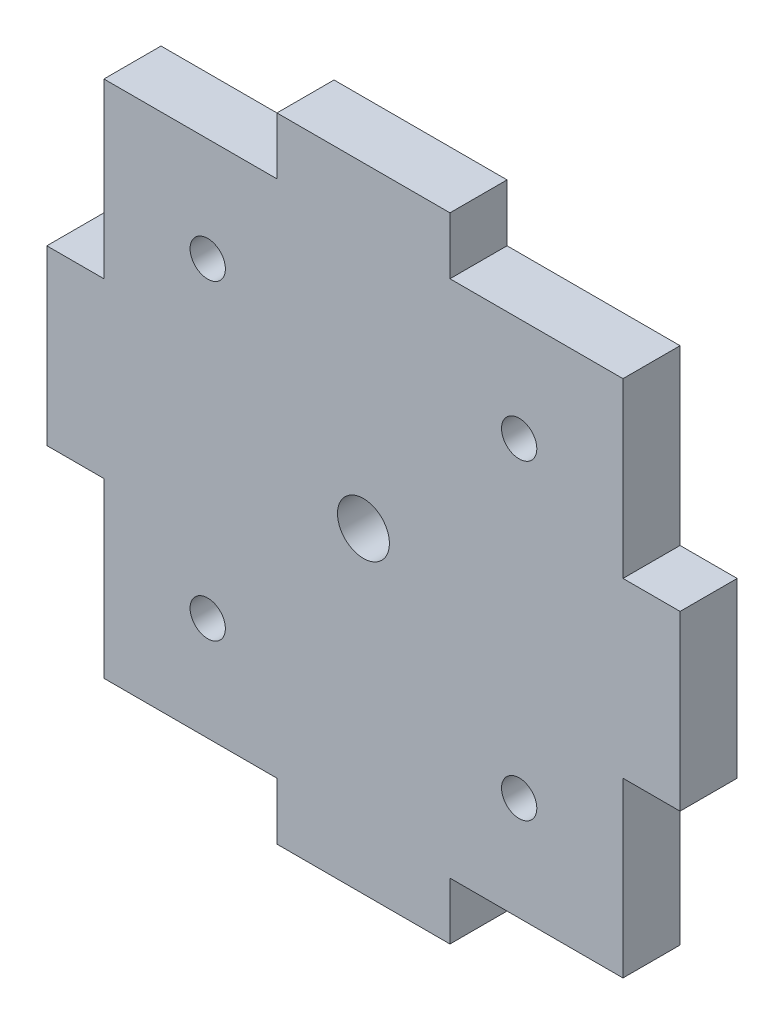
ISO-10303-21;
HEADER;
FILE_DESCRIPTION(('STEP AP214'),'2;1');
FILE_NAME('part.step','',(''),(''),'','','');
FILE_SCHEMA(('AUTOMOTIVE_DESIGN { 1 0 10303 214 1 1 1 1 }'));
ENDSEC;
DATA;
#1=APPLICATION_CONTEXT('core data for automotive mechanical design processes');
#2=APPLICATION_PROTOCOL_DEFINITION('international standard','automotive_design',2000,#1);
#3=PRODUCT_CONTEXT('',#1,'mechanical');
#4=PRODUCT('Part','Part','',(#3));
#5=PRODUCT_RELATED_PRODUCT_CATEGORY('part','',(#4));
#6=PRODUCT_DEFINITION_FORMATION('','',#4);
#7=PRODUCT_DEFINITION_CONTEXT('part definition',#1,'design');
#8=PRODUCT_DEFINITION('design','',#6,#7);
#9=PRODUCT_DEFINITION_SHAPE('','',#8);
#10=(LENGTH_UNIT() NAMED_UNIT(*) SI_UNIT(.MILLI.,.METRE.));
#11=(NAMED_UNIT(*) PLANE_ANGLE_UNIT() SI_UNIT($,.RADIAN.));
#12=(NAMED_UNIT(*) SI_UNIT($,.STERADIAN.) SOLID_ANGLE_UNIT());
#13=UNCERTAINTY_MEASURE_WITH_UNIT(LENGTH_MEASURE(1.E-05),#10,'distance_accuracy_value','');
#14=(GEOMETRIC_REPRESENTATION_CONTEXT(3) GLOBAL_UNCERTAINTY_ASSIGNED_CONTEXT((#13)) GLOBAL_UNIT_ASSIGNED_CONTEXT((#10,
#11,#12)) REPRESENTATION_CONTEXT('',''));
#15=CARTESIAN_POINT('',(0.,0.,0.));
#16=DIRECTION('',(0.,0.,1.));
#17=DIRECTION('',(1.,0.,0.));
#18=AXIS2_PLACEMENT_3D('',#15,#16,#17);
#19=CARTESIAN_POINT('',(0.,61.,5.5));
#20=DIRECTION('',(0.,0.,-1.));
#21=DIRECTION('',(-1.,0.,0.));
#22=AXIS2_PLACEMENT_3D('',#19,#20,#21);
#23=PLANE('',#22);
#24=CARTESIAN_POINT('',(45.5,45.5,5.49999999999999));
#25=DIRECTION('',(0.,0.,-1.));
#26=DIRECTION('',(1.,0.,0.));
#27=AXIS2_PLACEMENT_3D('',#24,#25,#26);
#28=CIRCLE('',#27,1.7);
#29=CARTESIAN_POINT('',(47.2,45.5,5.49999999999999));
#30=VERTEX_POINT('',#29);
#31=EDGE_CURVE('E610',#30,#30,#28,.T.);
#32=ORIENTED_EDGE('',*,*,#31,.T.);
#33=EDGE_LOOP('',(#32));
#34=FACE_BOUND('',#33,.T.);
#35=CARTESIAN_POINT('',(15.5,45.5,5.49999999999999));
#36=DIRECTION('',(0.,0.,-1.));
#37=DIRECTION('',(-1.,0.,0.));
#38=AXIS2_PLACEMENT_3D('',#35,#36,#37);
#39=CIRCLE('',#38,1.7);
#40=CARTESIAN_POINT('',(13.8,45.5,5.49999999999999));
#41=VERTEX_POINT('',#40);
#42=EDGE_CURVE('E202',#41,#41,#39,.T.);
#43=ORIENTED_EDGE('',*,*,#42,.T.);
#44=EDGE_LOOP('',(#43));
#45=FACE_BOUND('',#44,.T.);
#46=CARTESIAN_POINT('',(30.5,30.5,5.49999999999999));
#47=DIRECTION('',(0.,0.,-1.));
#48=DIRECTION('',(-1.,0.,0.));
#49=AXIS2_PLACEMENT_3D('',#46,#47,#48);
#50=CIRCLE('',#49,2.5);
#51=CARTESIAN_POINT('',(28.,30.5,5.49999999999999));
#52=VERTEX_POINT('',#51);
#53=EDGE_CURVE('E617',#52,#52,#50,.T.);
#54=ORIENTED_EDGE('',*,*,#53,.T.);
#55=EDGE_LOOP('',(#54));
#56=FACE_BOUND('',#55,.T.);
#57=CARTESIAN_POINT('',(45.5,15.5,5.49999999999999));
#58=DIRECTION('',(0.,0.,-1.));
#59=DIRECTION('',(-1.,0.,0.));
#60=AXIS2_PLACEMENT_3D('',#57,#58,#59);
#61=CIRCLE('',#60,1.7);
#62=CARTESIAN_POINT('',(43.8,15.5,5.49999999999999));
#63=VERTEX_POINT('',#62);
#64=EDGE_CURVE('E599',#63,#63,#61,.T.);
#65=ORIENTED_EDGE('',*,*,#64,.T.);
#66=EDGE_LOOP('',(#65));
#67=FACE_BOUND('',#66,.T.);
#68=CARTESIAN_POINT('',(15.5,15.5,5.49999999999999));
#69=DIRECTION('',(0.,0.,-1.));
#70=DIRECTION('',(-1.,0.,0.));
#71=AXIS2_PLACEMENT_3D('',#68,#69,#70);
#72=CIRCLE('',#71,1.7);
#73=CARTESIAN_POINT('',(13.8,15.5,5.49999999999999));
#74=VERTEX_POINT('',#73);
#75=EDGE_CURVE('E600',#74,#74,#72,.T.);
#76=ORIENTED_EDGE('',*,*,#75,.T.);
#77=EDGE_LOOP('',(#76));
#78=FACE_BOUND('',#77,.T.);
#79=DIRECTION('',(1.,0.,0.));
#80=VECTOR('',#79,1.);
#81=CARTESIAN_POINT('',(55.5,22.1666666666667,5.50000000000002));
#82=LINE('',#81,#80);
#83=CARTESIAN_POINT('',(55.5,22.1666666666667,5.50000000000002));
#84=VERTEX_POINT('',#83);
#85=CARTESIAN_POINT('',(61.,22.1666666666667,5.50000000000002));
#86=VERTEX_POINT('',#85);
#87=EDGE_CURVE('E297',#84,#86,#82,.T.);
#88=ORIENTED_EDGE('',*,*,#87,.T.);
#89=DIRECTION('',(0.,1.,0.));
#90=VECTOR('',#89,1.);
#91=CARTESIAN_POINT('',(61.,0.,5.5));
#92=LINE('',#91,#90);
#93=CARTESIAN_POINT('',(61.,38.8333333333333,5.50000000000002));
#94=VERTEX_POINT('',#93);
#95=EDGE_CURVE('E307',#86,#94,#92,.T.);
#96=ORIENTED_EDGE('',*,*,#95,.T.);
#97=DIRECTION('',(1.,0.,0.));
#98=VECTOR('',#97,1.);
#99=CARTESIAN_POINT('',(55.5,38.8333333333333,5.50000000000002));
#100=LINE('',#99,#98);
#101=CARTESIAN_POINT('',(55.5,38.8333333333333,5.50000000000002));
#102=VERTEX_POINT('',#101);
#103=EDGE_CURVE('E286',#102,#94,#100,.T.);
#104=ORIENTED_EDGE('',*,*,#103,.F.);
#105=DIRECTION('',(0.,1.,0.));
#106=VECTOR('',#105,1.);
#107=CARTESIAN_POINT('',(55.5,55.5,5.50000000000002));
#108=LINE('',#107,#106);
#109=CARTESIAN_POINT('',(55.5,55.5,5.50000000000002));
#110=VERTEX_POINT('',#109);
#111=EDGE_CURVE('E196',#102,#110,#108,.T.);
#112=ORIENTED_EDGE('',*,*,#111,.T.);
#113=DIRECTION('',(-1.,0.,0.));
#114=VECTOR('',#113,1.);
#115=CARTESIAN_POINT('',(55.5,55.5,5.50000000000001));
#116=LINE('',#115,#114);
#117=CARTESIAN_POINT('',(38.8333333333333,55.5,5.50000000000001));
#118=VERTEX_POINT('',#117);
#119=EDGE_CURVE('E187',#110,#118,#116,.T.);
#120=ORIENTED_EDGE('',*,*,#119,.T.);
#121=DIRECTION('',(0.,1.,0.));
#122=VECTOR('',#121,1.);
#123=CARTESIAN_POINT('',(38.8333333333333,55.5,5.50000000000001));
#124=LINE('',#123,#122);
#125=CARTESIAN_POINT('',(38.8333333333333,61.,5.50000000000001));
#126=VERTEX_POINT('',#125);
#127=EDGE_CURVE('E170',#118,#126,#124,.T.);
#128=ORIENTED_EDGE('',*,*,#127,.T.);
#129=DIRECTION('',(-1.,0.,0.));
#130=VECTOR('',#129,1.);
#131=CARTESIAN_POINT('',(0.,61.,5.5));
#132=LINE('',#131,#130);
#133=CARTESIAN_POINT('',(22.1666666666667,61.,5.50000000000001));
#134=VERTEX_POINT('',#133);
#135=EDGE_CURVE('E310',#126,#134,#132,.T.);
#136=ORIENTED_EDGE('',*,*,#135,.T.);
#137=DIRECTION('',(0.,1.,0.));
#138=VECTOR('',#137,1.);
#139=CARTESIAN_POINT('',(22.1666666666667,55.5,5.50000000000001));
#140=LINE('',#139,#138);
#141=CARTESIAN_POINT('',(22.1666666666667,55.5,5.50000000000001));
#142=VERTEX_POINT('',#141);
#143=EDGE_CURVE('E209',#142,#134,#140,.T.);
#144=ORIENTED_EDGE('',*,*,#143,.F.);
#145=DIRECTION('',(-1.,0.,0.));
#146=VECTOR('',#145,1.);
#147=CARTESIAN_POINT('',(5.5,55.5,5.50000000000001));
#148=LINE('',#147,#146);
#149=CARTESIAN_POINT('',(5.5,55.5,5.5));
#150=VERTEX_POINT('',#149);
#151=EDGE_CURVE('E206',#142,#150,#148,.T.);
#152=ORIENTED_EDGE('',*,*,#151,.T.);
#153=DIRECTION('',(0.,-1.,0.));
#154=VECTOR('',#153,1.);
#155=CARTESIAN_POINT('',(5.5,55.5,5.5));
#156=LINE('',#155,#154);
#157=CARTESIAN_POINT('',(5.5,38.8333333333334,5.5));
#158=VERTEX_POINT('',#157);
#159=EDGE_CURVE('E218',#150,#158,#156,.T.);
#160=ORIENTED_EDGE('',*,*,#159,.T.);
#161=DIRECTION('',(-1.,0.,0.));
#162=VECTOR('',#161,1.);
#163=CARTESIAN_POINT('',(5.5,38.8333333333334,5.5));
#164=LINE('',#163,#162);
#165=CARTESIAN_POINT('',(0.,38.8333333333334,5.5));
#166=VERTEX_POINT('',#165);
#167=EDGE_CURVE('E240',#158,#166,#164,.T.);
#168=ORIENTED_EDGE('',*,*,#167,.T.);
#169=DIRECTION('',(0.,-1.,0.));
#170=VECTOR('',#169,1.);
#171=CARTESIAN_POINT('',(0.,0.,5.5));
#172=LINE('',#171,#170);
#173=CARTESIAN_POINT('',(0.,22.1666666666667,5.49999999999999));
#174=VERTEX_POINT('',#173);
#175=EDGE_CURVE('E300',#166,#174,#172,.T.);
#176=ORIENTED_EDGE('',*,*,#175,.T.);
#177=DIRECTION('',(-1.,0.,0.));
#178=VECTOR('',#177,1.);
#179=CARTESIAN_POINT('',(5.5,22.1666666666667,5.49999999999999));
#180=LINE('',#179,#178);
#181=CARTESIAN_POINT('',(5.5,22.1666666666667,5.49999999999999));
#182=VERTEX_POINT('',#181);
#183=EDGE_CURVE('E229',#182,#174,#180,.T.);
#184=ORIENTED_EDGE('',*,*,#183,.F.);
#185=DIRECTION('',(0.,-1.,0.));
#186=VECTOR('',#185,1.);
#187=CARTESIAN_POINT('',(5.5,5.50000000000003,5.49999999999999));
#188=LINE('',#187,#186);
#189=CARTESIAN_POINT('',(5.5,5.5,5.5));
#190=VERTEX_POINT('',#189);
#191=EDGE_CURVE('E226',#182,#190,#188,.T.);
#192=ORIENTED_EDGE('',*,*,#191,.T.);
#193=DIRECTION('',(1.,0.,0.));
#194=VECTOR('',#193,1.);
#195=CARTESIAN_POINT('',(5.50000000000001,5.5,5.5));
#196=LINE('',#195,#194);
#197=CARTESIAN_POINT('',(22.1666666666667,5.5,5.50000000000001));
#198=VERTEX_POINT('',#197);
#199=EDGE_CURVE('E246',#190,#198,#196,.T.);
#200=ORIENTED_EDGE('',*,*,#199,.T.);
#201=DIRECTION('',(0.,-1.,0.));
#202=VECTOR('',#201,1.);
#203=CARTESIAN_POINT('',(22.1666666666667,5.5,5.50000000000001));
#204=LINE('',#203,#202);
#205=CARTESIAN_POINT('',(22.1666666666667,0.,5.50000000000001));
#206=VERTEX_POINT('',#205);
#207=EDGE_CURVE('E268',#198,#206,#204,.T.);
#208=ORIENTED_EDGE('',*,*,#207,.T.);
#209=DIRECTION('',(1.,0.,0.));
#210=VECTOR('',#209,1.);
#211=CARTESIAN_POINT('',(0.,0.,5.5));
#212=LINE('',#211,#210);
#213=CARTESIAN_POINT('',(38.8333333333333,0.,5.5));
#214=VERTEX_POINT('',#213);
#215=EDGE_CURVE('E303',#206,#214,#212,.T.);
#216=ORIENTED_EDGE('',*,*,#215,.T.);
#217=DIRECTION('',(0.,-1.,0.));
#218=VECTOR('',#217,1.);
#219=CARTESIAN_POINT('',(38.8333333333333,5.5,5.5));
#220=LINE('',#219,#218);
#221=CARTESIAN_POINT('',(38.8333333333333,5.5,5.5));
#222=VERTEX_POINT('',#221);
#223=EDGE_CURVE('E257',#222,#214,#220,.T.);
#224=ORIENTED_EDGE('',*,*,#223,.F.);
#225=DIRECTION('',(1.,0.,0.));
#226=VECTOR('',#225,1.);
#227=CARTESIAN_POINT('',(55.5,5.5,5.50000000000001));
#228=LINE('',#227,#226);
#229=CARTESIAN_POINT('',(55.5,5.5,5.50000000000002));
#230=VERTEX_POINT('',#229);
#231=EDGE_CURVE('E254',#222,#230,#228,.T.);
#232=ORIENTED_EDGE('',*,*,#231,.T.);
#233=DIRECTION('',(0.,1.,0.));
#234=VECTOR('',#233,1.);
#235=CARTESIAN_POINT('',(55.5,5.50000000000001,5.50000000000002));
#236=LINE('',#235,#234);
#237=EDGE_CURVE('E274',#230,#84,#236,.T.);
#238=ORIENTED_EDGE('',*,*,#237,.T.);
#239=EDGE_LOOP('',(#88,#96,#104,#112,#120,#128,#136,#144,#152,#160,#168,#176,#184,#192,#200,
#208,#216,#224,#232,#238));
#240=FACE_BOUND('',#239,.T.);
#241=ADVANCED_FACE('F31',(#34,#45,#56,#67,#78,#240),#23,.F.);
#242=CARTESIAN_POINT('',(0.,61.,0.));
#243=DIRECTION('',(0.,0.,-1.));
#244=DIRECTION('',(-1.,0.,0.));
#245=AXIS2_PLACEMENT_3D('',#242,#243,#244);
#246=PLANE('',#245);
#247=DIRECTION('',(0.,-1.,0.));
#248=VECTOR('',#247,1.);
#249=CARTESIAN_POINT('',(5.5,61.,0.));
#250=LINE('',#249,#248);
#251=CARTESIAN_POINT('',(5.5,22.1666666666667,0.));
#252=VERTEX_POINT('',#251);
#253=CARTESIAN_POINT('',(5.50000000000001,5.5,0.));
#254=VERTEX_POINT('',#253);
#255=EDGE_CURVE('E11',#252,#254,#250,.T.);
#256=ORIENTED_EDGE('',*,*,#255,.F.);
#257=DIRECTION('',(-1.,0.,0.));
#258=VECTOR('',#257,1.);
#259=CARTESIAN_POINT('',(5.5,22.1666666666667,0.));
#260=LINE('',#259,#258);
#261=CARTESIAN_POINT('',(0.,22.1666666666667,0.));
#262=VERTEX_POINT('',#261);
#263=EDGE_CURVE('E235',#252,#262,#260,.T.);
#264=ORIENTED_EDGE('',*,*,#263,.T.);
#265=DIRECTION('',(0.,-1.,0.));
#266=VECTOR('',#265,1.);
#267=CARTESIAN_POINT('',(0.,0.,0.));
#268=LINE('',#267,#266);
#269=CARTESIAN_POINT('',(0.,38.8333333333334,0.));
#270=VERTEX_POINT('',#269);
#271=EDGE_CURVE('E299',#270,#262,#268,.T.);
#272=ORIENTED_EDGE('',*,*,#271,.F.);
#273=DIRECTION('',(-1.,0.,0.));
#274=VECTOR('',#273,1.);
#275=CARTESIAN_POINT('',(5.5,38.8333333333334,0.));
#276=LINE('',#275,#274);
#277=CARTESIAN_POINT('',(5.5,38.8333333333334,0.));
#278=VERTEX_POINT('',#277);
#279=EDGE_CURVE('E238',#278,#270,#276,.T.);
#280=ORIENTED_EDGE('',*,*,#279,.F.);
#281=CARTESIAN_POINT('',(5.5,55.5,0.));
#282=VERTEX_POINT('',#281);
#283=EDGE_CURVE('E42',#282,#278,#250,.T.);
#284=ORIENTED_EDGE('',*,*,#283,.F.);
#285=DIRECTION('',(-1.,0.,0.));
#286=VECTOR('',#285,1.);
#287=CARTESIAN_POINT('',(0.,55.5,0.));
#288=LINE('',#287,#286);
#289=CARTESIAN_POINT('',(22.1666666666667,55.5,0.));
#290=VERTEX_POINT('',#289);
#291=EDGE_CURVE('E312',#290,#282,#288,.T.);
#292=ORIENTED_EDGE('',*,*,#291,.F.);
#293=DIRECTION('',(0.,1.,0.));
#294=VECTOR('',#293,1.);
#295=CARTESIAN_POINT('',(22.1666666666667,55.5,0.));
#296=LINE('',#295,#294);
#297=CARTESIAN_POINT('',(22.1666666666667,61.,0.));
#298=VERTEX_POINT('',#297);
#299=EDGE_CURVE('E212',#290,#298,#296,.T.);
#300=ORIENTED_EDGE('',*,*,#299,.T.);
#301=DIRECTION('',(-1.,0.,0.));
#302=VECTOR('',#301,1.);
#303=CARTESIAN_POINT('',(0.,61.,0.));
#304=LINE('',#303,#302);
#305=CARTESIAN_POINT('',(38.8333333333333,61.,0.));
#306=VERTEX_POINT('',#305);
#307=EDGE_CURVE('E304',#306,#298,#304,.T.);
#308=ORIENTED_EDGE('',*,*,#307,.F.);
#309=DIRECTION('',(0.,1.,0.));
#310=VECTOR('',#309,1.);
#311=CARTESIAN_POINT('',(38.8333333333333,55.5,0.));
#312=LINE('',#311,#310);
#313=CARTESIAN_POINT('',(38.8333333333333,55.5,0.));
#314=VERTEX_POINT('',#313);
#315=EDGE_CURVE('E182',#314,#306,#312,.T.);
#316=ORIENTED_EDGE('',*,*,#315,.F.);
#317=CARTESIAN_POINT('',(55.5,55.5,0.));
#318=VERTEX_POINT('',#317);
#319=EDGE_CURVE('E190',#318,#314,#288,.T.);
#320=ORIENTED_EDGE('',*,*,#319,.F.);
#321=DIRECTION('',(0.,1.,0.));
#322=VECTOR('',#321,1.);
#323=CARTESIAN_POINT('',(55.5,61.,0.));
#324=LINE('',#323,#322);
#325=CARTESIAN_POINT('',(55.5,38.8333333333333,0.));
#326=VERTEX_POINT('',#325);
#327=EDGE_CURVE('E324',#326,#318,#324,.T.);
#328=ORIENTED_EDGE('',*,*,#327,.F.);
#329=DIRECTION('',(1.,0.,0.));
#330=VECTOR('',#329,1.);
#331=CARTESIAN_POINT('',(55.5,38.8333333333333,0.));
#332=LINE('',#331,#330);
#333=CARTESIAN_POINT('',(61.,38.8333333333333,0.));
#334=VERTEX_POINT('',#333);
#335=EDGE_CURVE('E292',#326,#334,#332,.T.);
#336=ORIENTED_EDGE('',*,*,#335,.T.);
#337=DIRECTION('',(0.,1.,0.));
#338=VECTOR('',#337,1.);
#339=CARTESIAN_POINT('',(61.,0.,0.));
#340=LINE('',#339,#338);
#341=CARTESIAN_POINT('',(61.,22.1666666666667,0.));
#342=VERTEX_POINT('',#341);
#343=EDGE_CURVE('E318',#342,#334,#340,.T.);
#344=ORIENTED_EDGE('',*,*,#343,.F.);
#345=DIRECTION('',(1.,0.,0.));
#346=VECTOR('',#345,1.);
#347=CARTESIAN_POINT('',(55.5,22.1666666666667,0.));
#348=LINE('',#347,#346);
#349=CARTESIAN_POINT('',(55.5,22.1666666666667,0.));
#350=VERTEX_POINT('',#349);
#351=EDGE_CURVE('E295',#350,#342,#348,.T.);
#352=ORIENTED_EDGE('',*,*,#351,.F.);
#353=CARTESIAN_POINT('',(55.5,5.50000000000001,0.));
#354=VERTEX_POINT('',#353);
#355=EDGE_CURVE('E326',#354,#350,#324,.T.);
#356=ORIENTED_EDGE('',*,*,#355,.F.);
#357=DIRECTION('',(1.,0.,0.));
#358=VECTOR('',#357,1.);
#359=CARTESIAN_POINT('',(0.,5.5,0.));
#360=LINE('',#359,#358);
#361=CARTESIAN_POINT('',(38.8333333333333,5.5,0.));
#362=VERTEX_POINT('',#361);
#363=EDGE_CURVE('E327',#362,#354,#360,.T.);
#364=ORIENTED_EDGE('',*,*,#363,.F.);
#365=DIRECTION('',(0.,-1.,0.));
#366=VECTOR('',#365,1.);
#367=CARTESIAN_POINT('',(38.8333333333333,5.5,0.));
#368=LINE('',#367,#366);
#369=CARTESIAN_POINT('',(38.8333333333333,0.,0.));
#370=VERTEX_POINT('',#369);
#371=EDGE_CURVE('E263',#362,#370,#368,.T.);
#372=ORIENTED_EDGE('',*,*,#371,.T.);
#373=DIRECTION('',(1.,0.,0.));
#374=VECTOR('',#373,1.);
#375=CARTESIAN_POINT('',(0.,0.,0.));
#376=LINE('',#375,#374);
#377=CARTESIAN_POINT('',(22.1666666666667,0.,0.));
#378=VERTEX_POINT('',#377);
#379=EDGE_CURVE('E315',#378,#370,#376,.T.);
#380=ORIENTED_EDGE('',*,*,#379,.F.);
#381=DIRECTION('',(0.,-1.,0.));
#382=VECTOR('',#381,1.);
#383=CARTESIAN_POINT('',(22.1666666666667,5.5,0.));
#384=LINE('',#383,#382);
#385=CARTESIAN_POINT('',(22.1666666666667,5.5,0.));
#386=VERTEX_POINT('',#385);
#387=EDGE_CURVE('E266',#386,#378,#384,.T.);
#388=ORIENTED_EDGE('',*,*,#387,.F.);
#389=EDGE_CURVE('E40',#254,#386,#360,.T.);
#390=ORIENTED_EDGE('',*,*,#389,.F.);
#391=EDGE_LOOP('',(#256,#264,#272,#280,#284,#292,#300,#308,#316,#320,#328,#336,#344,#352,#356,
#364,#372,#380,#388,#390));
#392=FACE_BOUND('',#391,.T.);
#393=CARTESIAN_POINT('',(30.5,30.5,0.));
#394=DIRECTION('',(0.,0.,-1.));
#395=DIRECTION('',(-1.,0.,0.));
#396=AXIS2_PLACEMENT_3D('',#393,#394,#395);
#397=CIRCLE('',#396,2.5);
#398=CARTESIAN_POINT('',(28.,30.5,0.));
#399=VERTEX_POINT('',#398);
#400=EDGE_CURVE('E35',#399,#399,#397,.F.);
#401=ORIENTED_EDGE('',*,*,#400,.T.);
#402=EDGE_LOOP('',(#401));
#403=FACE_BOUND('',#402,.T.);
#404=ADVANCED_FACE('F341',(#392,#403),#246,.T.);
#405=CARTESIAN_POINT('',(0.,0.,5.5));
#406=DIRECTION('',(1.,0.,0.));
#407=DIRECTION('',(0.,0.,-1.));
#408=AXIS2_PLACEMENT_3D('',#405,#406,#407);
#409=PLANE('',#408);
#410=DIRECTION('',(0.,0.,-1.));
#411=VECTOR('',#410,1.);
#412=CARTESIAN_POINT('',(0.,38.8333333333334,0.));
#413=LINE('',#412,#411);
#414=EDGE_CURVE('E181',#166,#270,#413,.T.);
#415=ORIENTED_EDGE('',*,*,#414,.T.);
#416=ORIENTED_EDGE('',*,*,#271,.T.);
#417=DIRECTION('',(0.,0.,1.));
#418=VECTOR('',#417,1.);
#419=CARTESIAN_POINT('',(0.,22.1666666666667,0.));
#420=LINE('',#419,#418);
#421=EDGE_CURVE('E219',#262,#174,#420,.T.);
#422=ORIENTED_EDGE('',*,*,#421,.T.);
#423=ORIENTED_EDGE('',*,*,#175,.F.);
#424=EDGE_LOOP('',(#415,#416,#422,#423));
#425=FACE_BOUND('',#424,.T.);
#426=ADVANCED_FACE('F33',(#425),#409,.F.);
#427=CARTESIAN_POINT('',(0.,0.,5.5));
#428=DIRECTION('',(0.,1.,0.));
#429=DIRECTION('',(0.,0.,1.));
#430=AXIS2_PLACEMENT_3D('',#427,#428,#429);
#431=PLANE('',#430);
#432=DIRECTION('',(0.,0.,-1.));
#433=VECTOR('',#432,1.);
#434=CARTESIAN_POINT('',(22.1666666666667,0.,0.));
#435=LINE('',#434,#433);
#436=EDGE_CURVE('E243',#206,#378,#435,.T.);
#437=ORIENTED_EDGE('',*,*,#436,.T.);
#438=ORIENTED_EDGE('',*,*,#379,.T.);
#439=DIRECTION('',(0.,0.,1.));
#440=VECTOR('',#439,1.);
#441=CARTESIAN_POINT('',(38.8333333333333,0.,0.));
#442=LINE('',#441,#440);
#443=EDGE_CURVE('E247',#370,#214,#442,.T.);
#444=ORIENTED_EDGE('',*,*,#443,.T.);
#445=ORIENTED_EDGE('',*,*,#215,.F.);
#446=EDGE_LOOP('',(#437,#438,#444,#445));
#447=FACE_BOUND('',#446,.T.);
#448=ADVANCED_FACE('F386',(#447),#431,.F.);
#449=CARTESIAN_POINT('',(61.,0.,5.5));
#450=DIRECTION('',(-1.,0.,0.));
#451=DIRECTION('',(0.,0.,1.));
#452=AXIS2_PLACEMENT_3D('',#449,#450,#451);
#453=PLANE('',#452);
#454=DIRECTION('',(0.,0.,-1.));
#455=VECTOR('',#454,1.);
#456=CARTESIAN_POINT('',(61.,22.1666666666667,0.));
#457=LINE('',#456,#455);
#458=EDGE_CURVE('E271',#86,#342,#457,.T.);
#459=ORIENTED_EDGE('',*,*,#458,.T.);
#460=ORIENTED_EDGE('',*,*,#343,.T.);
#461=DIRECTION('',(0.,0.,1.));
#462=VECTOR('',#461,1.);
#463=CARTESIAN_POINT('',(61.,38.8333333333333,0.));
#464=LINE('',#463,#462);
#465=EDGE_CURVE('E275',#334,#94,#464,.T.);
#466=ORIENTED_EDGE('',*,*,#465,.T.);
#467=ORIENTED_EDGE('',*,*,#95,.F.);
#468=EDGE_LOOP('',(#459,#460,#466,#467));
#469=FACE_BOUND('',#468,.T.);
#470=ADVANCED_FACE('F345',(#469),#453,.F.);
#471=CARTESIAN_POINT('',(0.,61.,5.5));
#472=DIRECTION('',(0.,-1.,0.));
#473=DIRECTION('',(0.,0.,-1.));
#474=AXIS2_PLACEMENT_3D('',#471,#472,#473);
#475=PLANE('',#474);
#476=DIRECTION('',(0.,0.,-1.));
#477=VECTOR('',#476,1.);
#478=CARTESIAN_POINT('',(38.8333333333333,61.,0.));
#479=LINE('',#478,#477);
#480=EDGE_CURVE('E176',#126,#306,#479,.T.);
#481=ORIENTED_EDGE('',*,*,#480,.T.);
#482=ORIENTED_EDGE('',*,*,#307,.T.);
#483=DIRECTION('',(0.,0.,1.));
#484=VECTOR('',#483,1.);
#485=CARTESIAN_POINT('',(22.1666666666667,61.,0.));
#486=LINE('',#485,#484);
#487=EDGE_CURVE('E197',#298,#134,#486,.T.);
#488=ORIENTED_EDGE('',*,*,#487,.T.);
#489=ORIENTED_EDGE('',*,*,#135,.F.);
#490=EDGE_LOOP('',(#481,#482,#488,#489));
#491=FACE_BOUND('',#490,.T.);
#492=ADVANCED_FACE('F380',(#491),#475,.F.);
#493=CARTESIAN_POINT('',(5.49999999999999,55.5,-40.));
#494=DIRECTION('',(0.,-1.,0.));
#495=DIRECTION('',(-1.,0.,0.));
#496=AXIS2_PLACEMENT_3D('',#493,#494,#495);
#497=PLANE('',#496);
#498=ORIENTED_EDGE('',*,*,#291,.T.);
#499=DIRECTION('',(0.,0.,1.));
#500=VECTOR('',#499,1.);
#501=CARTESIAN_POINT('',(5.5,55.5,-26.6666666666667));
#502=LINE('',#501,#500);
#503=EDGE_CURVE('E216',#282,#150,#502,.T.);
#504=ORIENTED_EDGE('',*,*,#503,.T.);
#505=ORIENTED_EDGE('',*,*,#151,.F.);
#506=DIRECTION('',(0.,0.,1.));
#507=VECTOR('',#506,1.);
#508=CARTESIAN_POINT('',(22.1666666666667,55.5,0.));
#509=LINE('',#508,#507);
#510=EDGE_CURVE('E191',#290,#142,#509,.T.);
#511=ORIENTED_EDGE('',*,*,#510,.F.);
#512=EDGE_LOOP('',(#498,#504,#505,#511));
#513=FACE_BOUND('',#512,.T.);
#514=ADVANCED_FACE('F383',(#513),#497,.F.);
#515=CARTESIAN_POINT('',(22.1666666666667,55.5,0.));
#516=DIRECTION('',(-1.,0.,0.));
#517=DIRECTION('',(0.,1.,0.));
#518=AXIS2_PLACEMENT_3D('',#515,#516,#517);
#519=PLANE('',#518);
#520=ORIENTED_EDGE('',*,*,#487,.F.);
#521=ORIENTED_EDGE('',*,*,#299,.F.);
#522=ORIENTED_EDGE('',*,*,#510,.T.);
#523=ORIENTED_EDGE('',*,*,#143,.T.);
#524=EDGE_LOOP('',(#520,#521,#522,#523));
#525=FACE_BOUND('',#524,.T.);
#526=ADVANCED_FACE('F422',(#525),#519,.T.);
#527=CARTESIAN_POINT('',(5.5,5.50000000000003,-40.));
#528=DIRECTION('',(1.,0.,0.));
#529=DIRECTION('',(0.,-1.,0.));
#530=AXIS2_PLACEMENT_3D('',#527,#528,#529);
#531=PLANE('',#530);
#532=ORIENTED_EDGE('',*,*,#283,.T.);
#533=DIRECTION('',(0.,0.,-1.));
#534=VECTOR('',#533,1.);
#535=CARTESIAN_POINT('',(5.5,38.8333333333334,0.));
#536=LINE('',#535,#534);
#537=EDGE_CURVE('E222',#158,#278,#536,.T.);
#538=ORIENTED_EDGE('',*,*,#537,.F.);
#539=ORIENTED_EDGE('',*,*,#159,.F.);
#540=ORIENTED_EDGE('',*,*,#503,.F.);
#541=EDGE_LOOP('',(#532,#538,#539,#540));
#542=FACE_BOUND('',#541,.T.);
#543=ADVANCED_FACE('F414',(#542),#531,.F.);
#544=CARTESIAN_POINT('',(5.5,38.8333333333334,0.));
#545=DIRECTION('',(0.,1.,0.));
#546=DIRECTION('',(0.,0.,1.));
#547=AXIS2_PLACEMENT_3D('',#544,#545,#546);
#548=PLANE('',#547);
#549=ORIENTED_EDGE('',*,*,#414,.F.);
#550=ORIENTED_EDGE('',*,*,#167,.F.);
#551=ORIENTED_EDGE('',*,*,#537,.T.);
#552=ORIENTED_EDGE('',*,*,#279,.T.);
#553=EDGE_LOOP('',(#549,#550,#551,#552));
#554=FACE_BOUND('',#553,.T.);
#555=ADVANCED_FACE('F410',(#554),#548,.T.);
#556=ORIENTED_EDGE('',*,*,#319,.T.);
#557=DIRECTION('',(0.,0.,-1.));
#558=VECTOR('',#557,1.);
#559=CARTESIAN_POINT('',(38.8333333333333,55.5,0.));
#560=LINE('',#559,#558);
#561=EDGE_CURVE('E173',#118,#314,#560,.T.);
#562=ORIENTED_EDGE('',*,*,#561,.F.);
#563=ORIENTED_EDGE('',*,*,#119,.F.);
#564=DIRECTION('',(0.,0.,-1.));
#565=VECTOR('',#564,1.);
#566=CARTESIAN_POINT('',(55.5,55.5,0.));
#567=LINE('',#566,#565);
#568=EDGE_CURVE('E284',#110,#318,#567,.T.);
#569=ORIENTED_EDGE('',*,*,#568,.T.);
#570=EDGE_LOOP('',(#556,#562,#563,#569));
#571=FACE_BOUND('',#570,.T.);
#572=ADVANCED_FACE('F186',(#571),#497,.F.);
#573=CARTESIAN_POINT('',(38.8333333333333,55.5,0.));
#574=DIRECTION('',(1.,0.,0.));
#575=DIRECTION('',(0.,0.,1.));
#576=AXIS2_PLACEMENT_3D('',#573,#574,#575);
#577=PLANE('',#576);
#578=ORIENTED_EDGE('',*,*,#480,.F.);
#579=ORIENTED_EDGE('',*,*,#127,.F.);
#580=ORIENTED_EDGE('',*,*,#561,.T.);
#581=ORIENTED_EDGE('',*,*,#315,.T.);
#582=EDGE_LOOP('',(#578,#579,#580,#581));
#583=FACE_BOUND('',#582,.T.);
#584=ADVANCED_FACE('F172',(#583),#577,.T.);
#585=CARTESIAN_POINT('',(55.5,55.5,-40.));
#586=DIRECTION('',(-1.,0.,0.));
#587=DIRECTION('',(0.,1.,0.));
#588=AXIS2_PLACEMENT_3D('',#585,#586,#587);
#589=PLANE('',#588);
#590=ORIENTED_EDGE('',*,*,#327,.T.);
#591=ORIENTED_EDGE('',*,*,#568,.F.);
#592=ORIENTED_EDGE('',*,*,#111,.F.);
#593=DIRECTION('',(0.,0.,1.));
#594=VECTOR('',#593,1.);
#595=CARTESIAN_POINT('',(55.5,38.8333333333333,0.));
#596=LINE('',#595,#594);
#597=EDGE_CURVE('E281',#326,#102,#596,.T.);
#598=ORIENTED_EDGE('',*,*,#597,.F.);
#599=EDGE_LOOP('',(#590,#591,#592,#598));
#600=FACE_BOUND('',#599,.T.);
#601=ADVANCED_FACE('F434',(#600),#589,.F.);
#602=CARTESIAN_POINT('',(55.5,38.8333333333333,0.));
#603=DIRECTION('',(0.,1.,0.));
#604=DIRECTION('',(1.,0.,0.));
#605=AXIS2_PLACEMENT_3D('',#602,#603,#604);
#606=PLANE('',#605);
#607=ORIENTED_EDGE('',*,*,#465,.F.);
#608=ORIENTED_EDGE('',*,*,#335,.F.);
#609=ORIENTED_EDGE('',*,*,#597,.T.);
#610=ORIENTED_EDGE('',*,*,#103,.T.);
#611=EDGE_LOOP('',(#607,#608,#609,#610));
#612=FACE_BOUND('',#611,.T.);
#613=ADVANCED_FACE('F437',(#612),#606,.T.);
#614=ORIENTED_EDGE('',*,*,#255,.T.);
#615=DIRECTION('',(0.,0.,1.));
#616=VECTOR('',#615,1.);
#617=CARTESIAN_POINT('',(5.50000000000001,5.5,-26.6666666666667));
#618=LINE('',#617,#616);
#619=EDGE_CURVE('E244',#254,#190,#618,.T.);
#620=ORIENTED_EDGE('',*,*,#619,.T.);
#621=ORIENTED_EDGE('',*,*,#191,.F.);
#622=DIRECTION('',(0.,0.,1.));
#623=VECTOR('',#622,1.);
#624=CARTESIAN_POINT('',(5.5,22.1666666666667,0.));
#625=LINE('',#624,#623);
#626=EDGE_CURVE('E48',#252,#182,#625,.T.);
#627=ORIENTED_EDGE('',*,*,#626,.F.);
#628=EDGE_LOOP('',(#614,#620,#621,#627));
#629=FACE_BOUND('',#628,.T.);
#630=ADVANCED_FACE('F402',(#629),#531,.F.);
#631=CARTESIAN_POINT('',(5.5,22.1666666666667,0.));
#632=DIRECTION('',(0.,-1.,0.));
#633=DIRECTION('',(-1.,0.,0.));
#634=AXIS2_PLACEMENT_3D('',#631,#632,#633);
#635=PLANE('',#634);
#636=ORIENTED_EDGE('',*,*,#421,.F.);
#637=ORIENTED_EDGE('',*,*,#263,.F.);
#638=ORIENTED_EDGE('',*,*,#626,.T.);
#639=ORIENTED_EDGE('',*,*,#183,.T.);
#640=EDGE_LOOP('',(#636,#637,#638,#639));
#641=FACE_BOUND('',#640,.T.);
#642=ADVANCED_FACE('F366',(#641),#635,.T.);
#643=CARTESIAN_POINT('',(55.5,5.5,-40.));
#644=DIRECTION('',(0.,1.,0.));
#645=DIRECTION('',(1.,0.,0.));
#646=AXIS2_PLACEMENT_3D('',#643,#644,#645);
#647=PLANE('',#646);
#648=ORIENTED_EDGE('',*,*,#389,.T.);
#649=DIRECTION('',(0.,0.,-1.));
#650=VECTOR('',#649,1.);
#651=CARTESIAN_POINT('',(22.1666666666667,5.5,0.));
#652=LINE('',#651,#650);
#653=EDGE_CURVE('E250',#198,#386,#652,.T.);
#654=ORIENTED_EDGE('',*,*,#653,.F.);
#655=ORIENTED_EDGE('',*,*,#199,.F.);
#656=ORIENTED_EDGE('',*,*,#619,.F.);
#657=EDGE_LOOP('',(#648,#654,#655,#656));
#658=FACE_BOUND('',#657,.T.);
#659=ADVANCED_FACE('F353',(#658),#647,.F.);
#660=CARTESIAN_POINT('',(22.1666666666667,5.5,0.));
#661=DIRECTION('',(-1.,0.,0.));
#662=DIRECTION('',(0.,0.,1.));
#663=AXIS2_PLACEMENT_3D('',#660,#661,#662);
#664=PLANE('',#663);
#665=ORIENTED_EDGE('',*,*,#436,.F.);
#666=ORIENTED_EDGE('',*,*,#207,.F.);
#667=ORIENTED_EDGE('',*,*,#653,.T.);
#668=ORIENTED_EDGE('',*,*,#387,.T.);
#669=EDGE_LOOP('',(#665,#666,#667,#668));
#670=FACE_BOUND('',#669,.T.);
#671=ADVANCED_FACE('F365',(#670),#664,.T.);
#672=ORIENTED_EDGE('',*,*,#355,.T.);
#673=DIRECTION('',(0.,0.,-1.));
#674=VECTOR('',#673,1.);
#675=CARTESIAN_POINT('',(55.5,22.1666666666667,0.));
#676=LINE('',#675,#674);
#677=EDGE_CURVE('E278',#84,#350,#676,.T.);
#678=ORIENTED_EDGE('',*,*,#677,.F.);
#679=ORIENTED_EDGE('',*,*,#237,.F.);
#680=DIRECTION('',(0.,0.,1.));
#681=VECTOR('',#680,1.);
#682=CARTESIAN_POINT('',(55.5,5.50000000000001,-26.6666666666667));
#683=LINE('',#682,#681);
#684=EDGE_CURVE('E272',#354,#230,#683,.T.);
#685=ORIENTED_EDGE('',*,*,#684,.F.);
#686=EDGE_LOOP('',(#672,#678,#679,#685));
#687=FACE_BOUND('',#686,.T.);
#688=ADVANCED_FACE('F333',(#687),#589,.F.);
#689=CARTESIAN_POINT('',(55.5,22.1666666666667,0.));
#690=DIRECTION('',(0.,-1.,0.));
#691=DIRECTION('',(0.,0.,1.));
#692=AXIS2_PLACEMENT_3D('',#689,#690,#691);
#693=PLANE('',#692);
#694=ORIENTED_EDGE('',*,*,#458,.F.);
#695=ORIENTED_EDGE('',*,*,#87,.F.);
#696=ORIENTED_EDGE('',*,*,#677,.T.);
#697=ORIENTED_EDGE('',*,*,#351,.T.);
#698=EDGE_LOOP('',(#694,#695,#696,#697));
#699=FACE_BOUND('',#698,.T.);
#700=ADVANCED_FACE('F338',(#699),#693,.T.);
#701=CARTESIAN_POINT('',(38.8333333333333,5.5,0.));
#702=DIRECTION('',(1.,0.,0.));
#703=DIRECTION('',(0.,-1.,0.));
#704=AXIS2_PLACEMENT_3D('',#701,#702,#703);
#705=PLANE('',#704);
#706=ORIENTED_EDGE('',*,*,#443,.F.);
#707=ORIENTED_EDGE('',*,*,#371,.F.);
#708=DIRECTION('',(0.,0.,1.));
#709=VECTOR('',#708,1.);
#710=CARTESIAN_POINT('',(38.8333333333333,5.5,0.));
#711=LINE('',#710,#709);
#712=EDGE_CURVE('E56',#362,#222,#711,.T.);
#713=ORIENTED_EDGE('',*,*,#712,.T.);
#714=ORIENTED_EDGE('',*,*,#223,.T.);
#715=EDGE_LOOP('',(#706,#707,#713,#714));
#716=FACE_BOUND('',#715,.T.);
#717=ADVANCED_FACE('F351',(#716),#705,.T.);
#718=ORIENTED_EDGE('',*,*,#363,.T.);
#719=ORIENTED_EDGE('',*,*,#684,.T.);
#720=ORIENTED_EDGE('',*,*,#231,.F.);
#721=ORIENTED_EDGE('',*,*,#712,.F.);
#722=EDGE_LOOP('',(#718,#719,#720,#721));
#723=FACE_BOUND('',#722,.T.);
#724=ADVANCED_FACE('F348',(#723),#647,.F.);
#725=CARTESIAN_POINT('',(30.5,30.5,-14.5));
#726=DIRECTION('',(0.,0.,1.));
#727=DIRECTION('',(1.,0.,0.));
#728=AXIS2_PLACEMENT_3D('',#725,#726,#727);
#729=CYLINDRICAL_SURFACE('',#728,2.5);
#730=ORIENTED_EDGE('',*,*,#400,.F.);
#731=EDGE_LOOP('',(#730));
#732=FACE_BOUND('',#731,.T.);
#733=ORIENTED_EDGE('',*,*,#53,.F.);
#734=EDGE_LOOP('',(#733));
#735=FACE_BOUND('',#734,.T.);
#736=ADVANCED_FACE('F350',(#732,#735),#729,.F.);
#737=CARTESIAN_POINT('',(15.5,45.5,0.499999999999994));
#738=DIRECTION('',(0.,0.,-1.));
#739=DIRECTION('',(-1.,0.,0.));
#740=AXIS2_PLACEMENT_3D('',#737,#738,#739);
#741=PLANE('',#740);
#742=CARTESIAN_POINT('',(15.5,45.5,0.499999999999994));
#743=DIRECTION('',(0.,0.,1.));
#744=DIRECTION('',(-1.,0.,0.));
#745=AXIS2_PLACEMENT_3D('',#742,#743,#744);
#746=CIRCLE('',#745,1.7);
#747=CARTESIAN_POINT('',(13.8,45.5,0.499999999999994));
#748=VERTEX_POINT('',#747);
#749=EDGE_CURVE('E612',#748,#748,#746,.T.);
#750=ORIENTED_EDGE('',*,*,#749,.T.);
#751=EDGE_LOOP('',(#750));
#752=FACE_BOUND('',#751,.T.);
#753=ADVANCED_FACE('F358',(#752),#741,.F.);
#754=CARTESIAN_POINT('',(15.5,45.5,0.499999999999994));
#755=DIRECTION('',(0.,0.,1.));
#756=DIRECTION('',(1.,0.,0.));
#757=AXIS2_PLACEMENT_3D('',#754,#755,#756);
#758=CYLINDRICAL_SURFACE('',#757,1.7);
#759=ORIENTED_EDGE('',*,*,#749,.F.);
#760=EDGE_LOOP('',(#759));
#761=FACE_BOUND('',#760,.T.);
#762=ORIENTED_EDGE('',*,*,#42,.F.);
#763=EDGE_LOOP('',(#762));
#764=FACE_BOUND('',#763,.T.);
#765=ADVANCED_FACE('F523',(#761,#764),#758,.F.);
#766=CARTESIAN_POINT('',(45.5,45.5,0.499999999999994));
#767=DIRECTION('',(0.,0.,-1.));
#768=DIRECTION('',(1.,0.,0.));
#769=AXIS2_PLACEMENT_3D('',#766,#767,#768);
#770=PLANE('',#769);
#771=CARTESIAN_POINT('',(45.5,45.5,0.499999999999994));
#772=DIRECTION('',(0.,0.,-1.));
#773=DIRECTION('',(1.,0.,0.));
#774=AXIS2_PLACEMENT_3D('',#771,#772,#773);
#775=CIRCLE('',#774,1.7);
#776=CARTESIAN_POINT('',(47.2,45.5,0.499999999999994));
#777=VERTEX_POINT('',#776);
#778=EDGE_CURVE('E609',#777,#777,#775,.T.);
#779=ORIENTED_EDGE('',*,*,#778,.F.);
#780=EDGE_LOOP('',(#779));
#781=FACE_BOUND('',#780,.T.);
#782=ADVANCED_FACE('F533',(#781),#770,.F.);
#783=CARTESIAN_POINT('',(45.5,45.5,0.499999999999994));
#784=DIRECTION('',(0.,0.,1.));
#785=DIRECTION('',(1.,0.,0.));
#786=AXIS2_PLACEMENT_3D('',#783,#784,#785);
#787=CYLINDRICAL_SURFACE('',#786,1.7);
#788=ORIENTED_EDGE('',*,*,#778,.T.);
#789=EDGE_LOOP('',(#788));
#790=FACE_BOUND('',#789,.T.);
#791=ORIENTED_EDGE('',*,*,#31,.F.);
#792=EDGE_LOOP('',(#791));
#793=FACE_BOUND('',#792,.T.);
#794=ADVANCED_FACE('F543',(#790,#793),#787,.F.);
#795=CARTESIAN_POINT('',(45.5,15.5,0.499999999999994));
#796=DIRECTION('',(0.,0.,-1.));
#797=DIRECTION('',(1.,0.,0.));
#798=AXIS2_PLACEMENT_3D('',#795,#796,#797);
#799=PLANE('',#798);
#800=CARTESIAN_POINT('',(45.5,15.5,0.499999999999994));
#801=DIRECTION('',(0.,0.,1.));
#802=DIRECTION('',(1.,0.,0.));
#803=AXIS2_PLACEMENT_3D('',#800,#801,#802);
#804=CIRCLE('',#803,1.7);
#805=CARTESIAN_POINT('',(47.2,15.5,0.499999999999994));
#806=VERTEX_POINT('',#805);
#807=EDGE_CURVE('E604',#806,#806,#804,.T.);
#808=ORIENTED_EDGE('',*,*,#807,.T.);
#809=EDGE_LOOP('',(#808));
#810=FACE_BOUND('',#809,.T.);
#811=ADVANCED_FACE('F553',(#810),#799,.F.);
#812=CARTESIAN_POINT('',(45.5,15.5,0.499999999999994));
#813=DIRECTION('',(0.,0.,1.));
#814=DIRECTION('',(1.,0.,0.));
#815=AXIS2_PLACEMENT_3D('',#812,#813,#814);
#816=CYLINDRICAL_SURFACE('',#815,1.7);
#817=ORIENTED_EDGE('',*,*,#807,.F.);
#818=EDGE_LOOP('',(#817));
#819=FACE_BOUND('',#818,.T.);
#820=ORIENTED_EDGE('',*,*,#64,.F.);
#821=EDGE_LOOP('',(#820));
#822=FACE_BOUND('',#821,.T.);
#823=ADVANCED_FACE('F563',(#819,#822),#816,.F.);
#824=CARTESIAN_POINT('',(15.5,15.5,0.499999999999994));
#825=DIRECTION('',(0.,0.,1.));
#826=DIRECTION('',(1.,0.,0.));
#827=AXIS2_PLACEMENT_3D('',#824,#825,#826);
#828=CYLINDRICAL_SURFACE('',#827,1.7);
#829=CARTESIAN_POINT('',(15.5,15.5,0.499999999999994));
#830=DIRECTION('',(0.,0.,-1.));
#831=DIRECTION('',(-1.,0.,0.));
#832=AXIS2_PLACEMENT_3D('',#829,#830,#831);
#833=CIRCLE('',#832,1.7);
#834=CARTESIAN_POINT('',(13.8,15.5,0.499999999999994));
#835=VERTEX_POINT('',#834);
#836=EDGE_CURVE('E598',#835,#835,#833,.T.);
#837=ORIENTED_EDGE('',*,*,#836,.T.);
#838=EDGE_LOOP('',(#837));
#839=FACE_BOUND('',#838,.T.);
#840=ORIENTED_EDGE('',*,*,#75,.F.);
#841=EDGE_LOOP('',(#840));
#842=FACE_BOUND('',#841,.T.);
#843=ADVANCED_FACE('F573',(#839,#842),#828,.F.);
#844=CARTESIAN_POINT('',(15.5,15.5,0.499999999999994));
#845=DIRECTION('',(0.,0.,-1.));
#846=DIRECTION('',(-1.,0.,0.));
#847=AXIS2_PLACEMENT_3D('',#844,#845,#846);
#848=PLANE('',#847);
#849=ORIENTED_EDGE('',*,*,#836,.F.);
#850=EDGE_LOOP('',(#849));
#851=FACE_BOUND('',#850,.T.);
#852=ADVANCED_FACE('F583',(#851),#848,.F.);
#853=CLOSED_SHELL('',(#241,#404,#426,#448,#470,#492,#514,#526,#543,#555,#572,#584,#601,#613,
#630,#642,#659,#671,#688,#700,#717,#724,#736,#753,#765,#782,#794,#811,#823,#843,#852));
#854=MANIFOLD_SOLID_BREP('B2',#853);
#855=ADVANCED_BREP_SHAPE_REPRESENTATION('',(#18,#854),#14);
#856=SHAPE_DEFINITION_REPRESENTATION(#9,#855);
ENDSEC;
END-ISO-10303-21;
